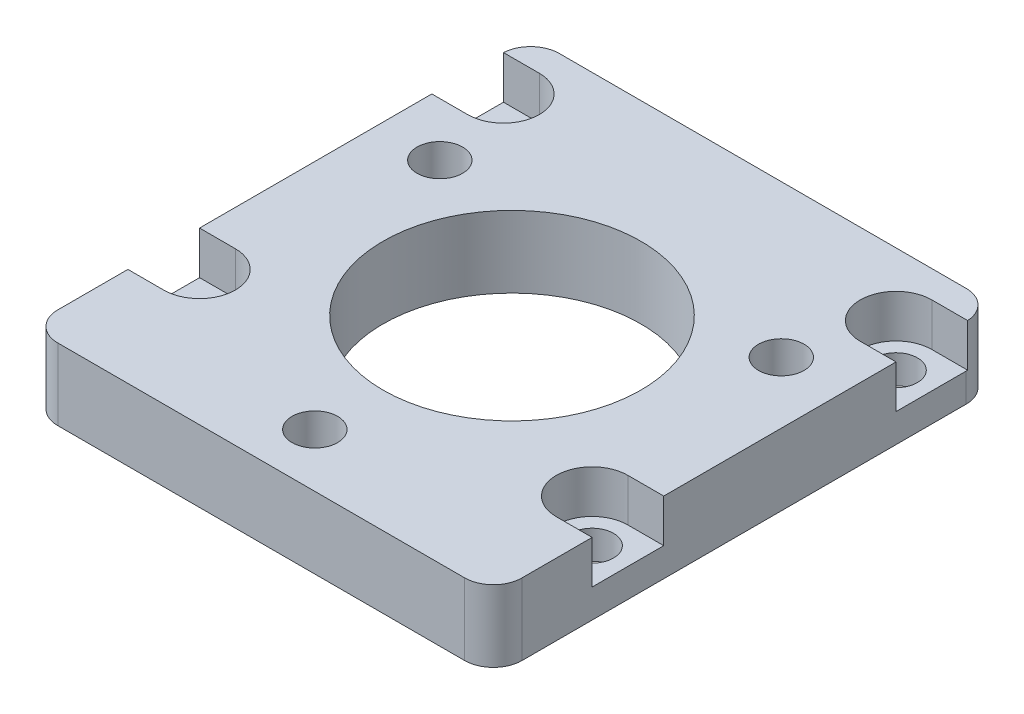
ISO-10303-21;
HEADER;
FILE_DESCRIPTION(('STEP AP214'),'2;1');
FILE_NAME('part.step','',(''),(''),'','','');
FILE_SCHEMA(('AUTOMOTIVE_DESIGN { 1 0 10303 214 1 1 1 1 }'));
ENDSEC;
DATA;
#1=APPLICATION_CONTEXT('core data for automotive mechanical design processes');
#2=APPLICATION_PROTOCOL_DEFINITION('international standard','automotive_design',2000,#1);
#3=PRODUCT_CONTEXT('',#1,'mechanical');
#4=PRODUCT('Part','Part','',(#3));
#5=PRODUCT_RELATED_PRODUCT_CATEGORY('part','',(#4));
#6=PRODUCT_DEFINITION_FORMATION('','',#4);
#7=PRODUCT_DEFINITION_CONTEXT('part definition',#1,'design');
#8=PRODUCT_DEFINITION('design','',#6,#7);
#9=PRODUCT_DEFINITION_SHAPE('','',#8);
#10=(LENGTH_UNIT() NAMED_UNIT(*) SI_UNIT(.MILLI.,.METRE.));
#11=(NAMED_UNIT(*) PLANE_ANGLE_UNIT() SI_UNIT($,.RADIAN.));
#12=(NAMED_UNIT(*) SI_UNIT($,.STERADIAN.) SOLID_ANGLE_UNIT());
#13=UNCERTAINTY_MEASURE_WITH_UNIT(LENGTH_MEASURE(1.E-05),#10,'distance_accuracy_value','');
#14=(GEOMETRIC_REPRESENTATION_CONTEXT(3) GLOBAL_UNCERTAINTY_ASSIGNED_CONTEXT((#13)) GLOBAL_UNIT_ASSIGNED_CONTEXT((#10,
#11,#12)) REPRESENTATION_CONTEXT('',''));
#15=CARTESIAN_POINT('',(0.,0.,0.));
#16=DIRECTION('',(0.,0.,1.));
#17=DIRECTION('',(1.,0.,0.));
#18=AXIS2_PLACEMENT_3D('',#15,#16,#17);
#19=CARTESIAN_POINT('',(-17.399,6.35,10.2953840772073));
#20=DIRECTION('',(0.,1.,0.));
#21=DIRECTION('',(0.,0.,1.));
#22=AXIS2_PLACEMENT_3D('',#19,#20,#21);
#23=CYLINDRICAL_SURFACE('',#22,1.89865);
#24=CARTESIAN_POINT('',(-17.399,0.,10.2953840772073));
#25=DIRECTION('',(0.,1.,0.));
#26=DIRECTION('',(0.,0.,1.));
#27=AXIS2_PLACEMENT_3D('',#24,#25,#26);
#28=CIRCLE('',#27,1.89865);
#29=CARTESIAN_POINT('',(-17.399,0.,12.1940340772073));
#30=VERTEX_POINT('',#29);
#31=EDGE_CURVE('E352',#30,#30,#28,.T.);
#32=ORIENTED_EDGE('',*,*,#31,.F.);
#33=EDGE_LOOP('',(#32));
#34=FACE_BOUND('',#33,.T.);
#35=CARTESIAN_POINT('',(-17.399,2.54,10.2953840772073));
#36=DIRECTION('',(0.,1.,0.));
#37=DIRECTION('',(0.,0.,1.));
#38=AXIS2_PLACEMENT_3D('',#35,#36,#37);
#39=CIRCLE('',#38,1.89865);
#40=CARTESIAN_POINT('',(-17.399,2.54,12.1940340772073));
#41=VERTEX_POINT('',#40);
#42=EDGE_CURVE('E328',#41,#41,#39,.F.);
#43=ORIENTED_EDGE('',*,*,#42,.F.);
#44=EDGE_LOOP('',(#43));
#45=FACE_BOUND('',#44,.T.);
#46=ADVANCED_FACE('F42',(#34,#45),#23,.F.);
#47=CARTESIAN_POINT('',(17.399,6.35,-16.645384286));
#48=DIRECTION('',(0.,1.,0.));
#49=DIRECTION('',(0.,0.,1.));
#50=AXIS2_PLACEMENT_3D('',#47,#48,#49);
#51=CYLINDRICAL_SURFACE('',#50,1.89865);
#52=CARTESIAN_POINT('',(17.399,0.,-16.645384286));
#53=DIRECTION('',(0.,1.,0.));
#54=DIRECTION('',(0.,0.,1.));
#55=AXIS2_PLACEMENT_3D('',#52,#53,#54);
#56=CIRCLE('',#55,1.89865);
#57=CARTESIAN_POINT('',(17.399,0.,-14.746734286));
#58=VERTEX_POINT('',#57);
#59=EDGE_CURVE('E346',#58,#58,#56,.T.);
#60=ORIENTED_EDGE('',*,*,#59,.F.);
#61=EDGE_LOOP('',(#60));
#62=FACE_BOUND('',#61,.T.);
#63=CARTESIAN_POINT('',(17.399,2.54,-16.645384286));
#64=DIRECTION('',(0.,1.,0.));
#65=DIRECTION('',(0.,0.,1.));
#66=AXIS2_PLACEMENT_3D('',#63,#64,#65);
#67=CIRCLE('',#66,1.89865);
#68=CARTESIAN_POINT('',(17.399,2.54,-14.746734286));
#69=VERTEX_POINT('',#68);
#70=EDGE_CURVE('E319',#69,#69,#67,.F.);
#71=ORIENTED_EDGE('',*,*,#70,.F.);
#72=EDGE_LOOP('',(#71));
#73=FACE_BOUND('',#72,.T.);
#74=ADVANCED_FACE('F505',(#62,#73),#51,.F.);
#75=CARTESIAN_POINT('',(-20.574,6.35,22.225));
#76=DIRECTION('',(1.,0.,0.));
#77=DIRECTION('',(0.,0.,-1.));
#78=AXIS2_PLACEMENT_3D('',#75,#76,#77);
#79=PLANE('',#78);
#80=DIRECTION('',(0.,0.,1.));
#81=VECTOR('',#80,1.);
#82=CARTESIAN_POINT('',(-20.574,6.35,22.225));
#83=LINE('',#82,#81);
#84=CARTESIAN_POINT('',(-20.574,6.35,13.470384286));
#85=VERTEX_POINT('',#84);
#86=CARTESIAN_POINT('',(-20.574,6.35,19.685));
#87=VERTEX_POINT('',#86);
#88=EDGE_CURVE('E362',#85,#87,#83,.T.);
#89=ORIENTED_EDGE('',*,*,#88,.F.);
#90=DIRECTION('',(0.,1.,0.));
#91=VECTOR('',#90,1.);
#92=CARTESIAN_POINT('',(-20.574,2.54,13.470384286));
#93=LINE('',#92,#91);
#94=CARTESIAN_POINT('',(-20.574,2.54,13.470384286));
#95=VERTEX_POINT('',#94);
#96=EDGE_CURVE('E287',#95,#85,#93,.T.);
#97=ORIENTED_EDGE('',*,*,#96,.F.);
#98=DIRECTION('',(0.,0.,1.));
#99=VECTOR('',#98,1.);
#100=CARTESIAN_POINT('',(-20.574,2.54,7.120384286));
#101=LINE('',#100,#99);
#102=CARTESIAN_POINT('',(-20.574,2.54,7.120384286));
#103=VERTEX_POINT('',#102);
#104=EDGE_CURVE('E275',#103,#95,#101,.T.);
#105=ORIENTED_EDGE('',*,*,#104,.F.);
#106=DIRECTION('',(0.,1.,0.));
#107=VECTOR('',#106,1.);
#108=CARTESIAN_POINT('',(-20.574,2.54,7.120384286));
#109=LINE('',#108,#107);
#110=CARTESIAN_POINT('',(-20.574,6.35,7.120384286));
#111=VERTEX_POINT('',#110);
#112=EDGE_CURVE('E289',#103,#111,#109,.T.);
#113=ORIENTED_EDGE('',*,*,#112,.T.);
#114=CARTESIAN_POINT('',(-20.574,6.35,-13.470384286));
#115=VERTEX_POINT('',#114);
#116=EDGE_CURVE('E364',#115,#111,#83,.T.);
#117=ORIENTED_EDGE('',*,*,#116,.F.);
#118=DIRECTION('',(0.,1.,0.));
#119=VECTOR('',#118,1.);
#120=CARTESIAN_POINT('',(-20.574,2.54,-13.470384286));
#121=LINE('',#120,#119);
#122=CARTESIAN_POINT('',(-20.574,2.54,-13.470384286));
#123=VERTEX_POINT('',#122);
#124=EDGE_CURVE('E314',#123,#115,#121,.T.);
#125=ORIENTED_EDGE('',*,*,#124,.F.);
#126=DIRECTION('',(0.,0.,1.));
#127=VECTOR('',#126,1.);
#128=CARTESIAN_POINT('',(-20.574,2.54,-13.470384286));
#129=LINE('',#128,#127);
#130=CARTESIAN_POINT('',(-20.574,2.54,-19.685));
#131=VERTEX_POINT('',#130);
#132=EDGE_CURVE('E299',#131,#123,#129,.T.);
#133=ORIENTED_EDGE('',*,*,#132,.F.);
#134=DIRECTION('',(0.,-1.,0.));
#135=VECTOR('',#134,1.);
#136=CARTESIAN_POINT('',(-20.574,6.35,-19.685));
#137=LINE('',#136,#135);
#138=CARTESIAN_POINT('',(-20.574,0.,-19.685));
#139=VERTEX_POINT('',#138);
#140=EDGE_CURVE('E389',#131,#139,#137,.T.);
#141=ORIENTED_EDGE('',*,*,#140,.T.);
#142=DIRECTION('',(0.,0.,1.));
#143=VECTOR('',#142,1.);
#144=CARTESIAN_POINT('',(-20.574,0.,22.225));
#145=LINE('',#144,#143);
#146=CARTESIAN_POINT('',(-20.574,0.,19.685));
#147=VERTEX_POINT('',#146);
#148=EDGE_CURVE('E359',#139,#147,#145,.T.);
#149=ORIENTED_EDGE('',*,*,#148,.T.);
#150=DIRECTION('',(0.,-1.,0.));
#151=VECTOR('',#150,1.);
#152=CARTESIAN_POINT('',(-20.574,6.35,19.685));
#153=LINE('',#152,#151);
#154=EDGE_CURVE('E376',#147,#87,#153,.F.);
#155=ORIENTED_EDGE('',*,*,#154,.T.);
#156=EDGE_LOOP('',(#89,#97,#105,#113,#117,#125,#133,#141,#149,#155));
#157=FACE_BOUND('',#156,.T.);
#158=ADVANCED_FACE('F474',(#157),#79,.F.);
#159=CARTESIAN_POINT('',(20.574,6.35,22.225));
#160=DIRECTION('',(0.,0.,-1.));
#161=DIRECTION('',(-1.,0.,0.));
#162=AXIS2_PLACEMENT_3D('',#159,#160,#161);
#163=PLANE('',#162);
#164=DIRECTION('',(1.,0.,0.));
#165=VECTOR('',#164,1.);
#166=CARTESIAN_POINT('',(20.574,0.,22.225));
#167=LINE('',#166,#165);
#168=CARTESIAN_POINT('',(-18.034,0.,22.225));
#169=VERTEX_POINT('',#168);
#170=CARTESIAN_POINT('',(18.034,0.,22.225));
#171=VERTEX_POINT('',#170);
#172=EDGE_CURVE('E379',#169,#171,#167,.T.);
#173=ORIENTED_EDGE('',*,*,#172,.T.);
#174=DIRECTION('',(0.,-1.,0.));
#175=VECTOR('',#174,1.);
#176=CARTESIAN_POINT('',(18.034,6.35,22.225));
#177=LINE('',#176,#175);
#178=CARTESIAN_POINT('',(18.034,6.35,22.225));
#179=VERTEX_POINT('',#178);
#180=EDGE_CURVE('E422',#171,#179,#177,.F.);
#181=ORIENTED_EDGE('',*,*,#180,.T.);
#182=DIRECTION('',(1.,0.,0.));
#183=VECTOR('',#182,1.);
#184=CARTESIAN_POINT('',(20.574,6.35,22.225));
#185=LINE('',#184,#183);
#186=CARTESIAN_POINT('',(-18.034,6.35,22.225));
#187=VERTEX_POINT('',#186);
#188=EDGE_CURVE('E366',#187,#179,#185,.T.);
#189=ORIENTED_EDGE('',*,*,#188,.F.);
#190=DIRECTION('',(0.,-1.,0.));
#191=VECTOR('',#190,1.);
#192=CARTESIAN_POINT('',(-18.034,6.35,22.225));
#193=LINE('',#192,#191);
#194=EDGE_CURVE('E419',#187,#169,#193,.T.);
#195=ORIENTED_EDGE('',*,*,#194,.T.);
#196=EDGE_LOOP('',(#173,#181,#189,#195));
#197=FACE_BOUND('',#196,.T.);
#198=ADVANCED_FACE('F532',(#197),#163,.F.);
#199=CARTESIAN_POINT('',(20.574,6.35,22.225));
#200=DIRECTION('',(-1.,0.,0.));
#201=DIRECTION('',(0.,0.,1.));
#202=AXIS2_PLACEMENT_3D('',#199,#200,#201);
#203=PLANE('',#202);
#204=DIRECTION('',(0.,0.,-1.));
#205=VECTOR('',#204,1.);
#206=CARTESIAN_POINT('',(20.574,6.35,22.225));
#207=LINE('',#206,#205);
#208=CARTESIAN_POINT('',(20.574,6.35,7.120384286));
#209=VERTEX_POINT('',#208);
#210=CARTESIAN_POINT('',(20.574,6.35,-13.470384286));
#211=VERTEX_POINT('',#210);
#212=EDGE_CURVE('E369',#209,#211,#207,.T.);
#213=ORIENTED_EDGE('',*,*,#212,.F.);
#214=DIRECTION('',(0.,1.,0.));
#215=VECTOR('',#214,1.);
#216=CARTESIAN_POINT('',(20.574,2.54,7.120384286));
#217=LINE('',#216,#215);
#218=CARTESIAN_POINT('',(20.574,2.54,7.120384286));
#219=VERTEX_POINT('',#218);
#220=EDGE_CURVE('E262',#219,#209,#217,.T.);
#221=ORIENTED_EDGE('',*,*,#220,.F.);
#222=DIRECTION('',(0.,0.,-1.));
#223=VECTOR('',#222,1.);
#224=CARTESIAN_POINT('',(20.574,2.54,7.120384286));
#225=LINE('',#224,#223);
#226=CARTESIAN_POINT('',(20.574,2.54,13.470384286));
#227=VERTEX_POINT('',#226);
#228=EDGE_CURVE('E249',#227,#219,#225,.T.);
#229=ORIENTED_EDGE('',*,*,#228,.F.);
#230=DIRECTION('',(0.,1.,0.));
#231=VECTOR('',#230,1.);
#232=CARTESIAN_POINT('',(20.574,2.54,13.470384286));
#233=LINE('',#232,#231);
#234=CARTESIAN_POINT('',(20.574,6.35,13.470384286));
#235=VERTEX_POINT('',#234);
#236=EDGE_CURVE('E264',#227,#235,#233,.T.);
#237=ORIENTED_EDGE('',*,*,#236,.T.);
#238=CARTESIAN_POINT('',(20.574,6.35,19.685));
#239=VERTEX_POINT('',#238);
#240=EDGE_CURVE('E370',#239,#235,#207,.T.);
#241=ORIENTED_EDGE('',*,*,#240,.F.);
#242=DIRECTION('',(0.,-1.,0.));
#243=VECTOR('',#242,1.);
#244=CARTESIAN_POINT('',(20.574,6.35,19.685));
#245=LINE('',#244,#243);
#246=CARTESIAN_POINT('',(20.574,0.,19.685));
#247=VERTEX_POINT('',#246);
#248=EDGE_CURVE('E413',#239,#247,#245,.T.);
#249=ORIENTED_EDGE('',*,*,#248,.T.);
#250=DIRECTION('',(0.,0.,-1.));
#251=VECTOR('',#250,1.);
#252=CARTESIAN_POINT('',(20.574,0.,22.225));
#253=LINE('',#252,#251);
#254=CARTESIAN_POINT('',(20.574,0.,-19.685));
#255=VERTEX_POINT('',#254);
#256=EDGE_CURVE('E382',#247,#255,#253,.T.);
#257=ORIENTED_EDGE('',*,*,#256,.T.);
#258=DIRECTION('',(0.,-1.,0.));
#259=VECTOR('',#258,1.);
#260=CARTESIAN_POINT('',(20.574,6.35,-19.685));
#261=LINE('',#260,#259);
#262=CARTESIAN_POINT('',(20.574,2.54,-19.685));
#263=VERTEX_POINT('',#262);
#264=EDGE_CURVE('E416',#255,#263,#261,.F.);
#265=ORIENTED_EDGE('',*,*,#264,.T.);
#266=DIRECTION('',(0.,0.,-1.));
#267=VECTOR('',#266,1.);
#268=CARTESIAN_POINT('',(20.574,2.54,-13.470384286));
#269=LINE('',#268,#267);
#270=CARTESIAN_POINT('',(20.574,2.54,-13.470384286));
#271=VERTEX_POINT('',#270);
#272=EDGE_CURVE('E222',#271,#263,#269,.T.);
#273=ORIENTED_EDGE('',*,*,#272,.F.);
#274=DIRECTION('',(0.,1.,0.));
#275=VECTOR('',#274,1.);
#276=CARTESIAN_POINT('',(20.574,2.54,-13.470384286));
#277=LINE('',#276,#275);
#278=EDGE_CURVE('E213',#271,#211,#277,.T.);
#279=ORIENTED_EDGE('',*,*,#278,.T.);
#280=EDGE_LOOP('',(#213,#221,#229,#237,#241,#249,#257,#265,#273,#279));
#281=FACE_BOUND('',#280,.T.);
#282=ADVANCED_FACE('F529',(#281),#203,.F.);
#283=CARTESIAN_POINT('',(20.574,6.35,-22.225));
#284=DIRECTION('',(0.,0.,1.));
#285=DIRECTION('',(1.,0.,0.));
#286=AXIS2_PLACEMENT_3D('',#283,#284,#285);
#287=PLANE('',#286);
#288=DIRECTION('',(-1.,0.,0.));
#289=VECTOR('',#288,1.);
#290=CARTESIAN_POINT('',(20.574,0.,-22.225));
#291=LINE('',#290,#289);
#292=CARTESIAN_POINT('',(18.034,0.,-22.225));
#293=VERTEX_POINT('',#292);
#294=CARTESIAN_POINT('',(-18.034,0.,-22.225));
#295=VERTEX_POINT('',#294);
#296=EDGE_CURVE('E365',#293,#295,#291,.T.);
#297=ORIENTED_EDGE('',*,*,#296,.T.);
#298=DIRECTION('',(0.,-1.,0.));
#299=VECTOR('',#298,1.);
#300=CARTESIAN_POINT('',(-18.034,6.35,-22.225));
#301=LINE('',#300,#299);
#302=CARTESIAN_POINT('',(-18.034,6.35,-22.225));
#303=VERTEX_POINT('',#302);
#304=EDGE_CURVE('E402',#295,#303,#301,.F.);
#305=ORIENTED_EDGE('',*,*,#304,.T.);
#306=DIRECTION('',(-1.,0.,0.));
#307=VECTOR('',#306,1.);
#308=CARTESIAN_POINT('',(20.574,6.35,-22.225));
#309=LINE('',#308,#307);
#310=CARTESIAN_POINT('',(18.034,6.35,-22.225));
#311=VERTEX_POINT('',#310);
#312=EDGE_CURVE('E373',#311,#303,#309,.T.);
#313=ORIENTED_EDGE('',*,*,#312,.F.);
#314=DIRECTION('',(0.,-1.,0.));
#315=VECTOR('',#314,1.);
#316=CARTESIAN_POINT('',(18.034,6.35,-22.225));
#317=LINE('',#316,#315);
#318=EDGE_CURVE('E399',#311,#293,#317,.T.);
#319=ORIENTED_EDGE('',*,*,#318,.T.);
#320=EDGE_LOOP('',(#297,#305,#313,#319));
#321=FACE_BOUND('',#320,.T.);
#322=ADVANCED_FACE('F447',(#321),#287,.F.);
#323=CARTESIAN_POINT('',(0.,6.35,0.));
#324=DIRECTION('',(0.,1.,0.));
#325=DIRECTION('',(0.,0.,1.));
#326=AXIS2_PLACEMENT_3D('',#323,#324,#325);
#327=PLANE('',#326);
#328=DIRECTION('',(1.,0.,0.));
#329=VECTOR('',#328,1.);
#330=CARTESIAN_POINT('',(-20.574,6.35,13.470384286));
#331=LINE('',#330,#329);
#332=CARTESIAN_POINT('',(-17.399,6.35,13.470384286));
#333=VERTEX_POINT('',#332);
#334=EDGE_CURVE('E272',#85,#333,#331,.T.);
#335=ORIENTED_EDGE('',*,*,#334,.F.);
#336=ORIENTED_EDGE('',*,*,#88,.T.);
#337=CARTESIAN_POINT('',(-18.034,6.35,19.685));
#338=DIRECTION('',(0.,1.,0.));
#339=DIRECTION('',(0.,0.,1.));
#340=AXIS2_PLACEMENT_3D('',#337,#338,#339);
#341=CIRCLE('',#340,2.54);
#342=EDGE_CURVE('E404',#87,#187,#341,.T.);
#343=ORIENTED_EDGE('',*,*,#342,.T.);
#344=ORIENTED_EDGE('',*,*,#188,.T.);
#345=CARTESIAN_POINT('',(18.034,6.35,19.685));
#346=DIRECTION('',(0.,1.,0.));
#347=DIRECTION('',(0.,0.,1.));
#348=AXIS2_PLACEMENT_3D('',#345,#346,#347);
#349=CIRCLE('',#348,2.54);
#350=EDGE_CURVE('E406',#179,#239,#349,.T.);
#351=ORIENTED_EDGE('',*,*,#350,.T.);
#352=ORIENTED_EDGE('',*,*,#240,.T.);
#353=DIRECTION('',(1.,0.,0.));
#354=VECTOR('',#353,1.);
#355=CARTESIAN_POINT('',(20.574,6.35,13.470384286));
#356=LINE('',#355,#354);
#357=CARTESIAN_POINT('',(17.399,6.35,13.470384286));
#358=VERTEX_POINT('',#357);
#359=EDGE_CURVE('E256',#358,#235,#356,.T.);
#360=ORIENTED_EDGE('',*,*,#359,.F.);
#361=CARTESIAN_POINT('',(17.399,6.35,10.295384286));
#362=DIRECTION('',(0.,1.,0.));
#363=DIRECTION('',(0.,0.,-1.));
#364=AXIS2_PLACEMENT_3D('',#361,#362,#363);
#365=CIRCLE('',#364,3.175);
#366=CARTESIAN_POINT('',(17.399,6.35,7.120384286));
#367=VERTEX_POINT('',#366);
#368=EDGE_CURVE('E65',#367,#358,#365,.T.);
#369=ORIENTED_EDGE('',*,*,#368,.F.);
#370=DIRECTION('',(-1.,0.,0.));
#371=VECTOR('',#370,1.);
#372=CARTESIAN_POINT('',(17.399,6.35,7.120384286));
#373=LINE('',#372,#371);
#374=EDGE_CURVE('E246',#209,#367,#373,.T.);
#375=ORIENTED_EDGE('',*,*,#374,.F.);
#376=ORIENTED_EDGE('',*,*,#212,.T.);
#377=DIRECTION('',(1.,0.,0.));
#378=VECTOR('',#377,1.);
#379=CARTESIAN_POINT('',(17.399,6.35,-13.470384286));
#380=LINE('',#379,#378);
#381=CARTESIAN_POINT('',(17.399,6.35,-13.470384286));
#382=VERTEX_POINT('',#381);
#383=EDGE_CURVE('E230',#382,#211,#380,.T.);
#384=ORIENTED_EDGE('',*,*,#383,.F.);
#385=CARTESIAN_POINT('',(17.399,6.35,-16.645384286));
#386=DIRECTION('',(0.,1.,0.));
#387=DIRECTION('',(0.,0.,1.));
#388=AXIS2_PLACEMENT_3D('',#385,#386,#387);
#389=CIRCLE('',#388,3.175);
#390=CARTESIAN_POINT('',(17.399,6.35,-19.820384286));
#391=VERTEX_POINT('',#390);
#392=EDGE_CURVE('E210',#391,#382,#389,.T.);
#393=ORIENTED_EDGE('',*,*,#392,.F.);
#394=DIRECTION('',(-1.,0.,0.));
#395=VECTOR('',#394,1.);
#396=CARTESIAN_POINT('',(20.574,6.35,-19.820384286));
#397=LINE('',#396,#395);
#398=CARTESIAN_POINT('',(20.5703893816022,6.35,-19.820384286));
#399=VERTEX_POINT('',#398);
#400=EDGE_CURVE('E228',#399,#391,#397,.T.);
#401=ORIENTED_EDGE('',*,*,#400,.F.);
#402=CARTESIAN_POINT('',(18.034,6.35,-19.685));
#403=DIRECTION('',(0.,1.,0.));
#404=DIRECTION('',(0.,0.,1.));
#405=AXIS2_PLACEMENT_3D('',#402,#403,#404);
#406=CIRCLE('',#405,2.54);
#407=EDGE_CURVE('E408',#399,#311,#406,.T.);
#408=ORIENTED_EDGE('',*,*,#407,.T.);
#409=ORIENTED_EDGE('',*,*,#312,.T.);
#410=CARTESIAN_POINT('',(-18.034,6.35,-19.685));
#411=DIRECTION('',(0.,1.,0.));
#412=DIRECTION('',(0.,0.,1.));
#413=AXIS2_PLACEMENT_3D('',#410,#411,#412);
#414=CIRCLE('',#413,2.54);
#415=CARTESIAN_POINT('',(-20.5703893816022,6.35,-19.820384286));
#416=VERTEX_POINT('',#415);
#417=EDGE_CURVE('E410',#303,#416,#414,.T.);
#418=ORIENTED_EDGE('',*,*,#417,.T.);
#419=DIRECTION('',(-1.,0.,0.));
#420=VECTOR('',#419,1.);
#421=CARTESIAN_POINT('',(-20.574,6.35,-19.820384286));
#422=LINE('',#421,#420);
#423=CARTESIAN_POINT('',(-17.399,6.35,-19.820384286));
#424=VERTEX_POINT('',#423);
#425=EDGE_CURVE('E307',#424,#416,#422,.T.);
#426=ORIENTED_EDGE('',*,*,#425,.F.);
#427=CARTESIAN_POINT('',(-17.399,6.35,-16.645384286));
#428=DIRECTION('',(0.,1.,0.));
#429=DIRECTION('',(0.,0.,-1.));
#430=AXIS2_PLACEMENT_3D('',#427,#428,#429);
#431=CIRCLE('',#430,3.175);
#432=CARTESIAN_POINT('',(-17.399,6.35,-13.470384286));
#433=VERTEX_POINT('',#432);
#434=EDGE_CURVE('E240',#433,#424,#431,.T.);
#435=ORIENTED_EDGE('',*,*,#434,.F.);
#436=DIRECTION('',(1.,0.,0.));
#437=VECTOR('',#436,1.);
#438=CARTESIAN_POINT('',(-17.399,6.35,-13.470384286));
#439=LINE('',#438,#437);
#440=EDGE_CURVE('E297',#115,#433,#439,.T.);
#441=ORIENTED_EDGE('',*,*,#440,.F.);
#442=ORIENTED_EDGE('',*,*,#116,.T.);
#443=DIRECTION('',(-1.,0.,0.));
#444=VECTOR('',#443,1.);
#445=CARTESIAN_POINT('',(-17.399,6.35,7.120384286));
#446=LINE('',#445,#444);
#447=CARTESIAN_POINT('',(-17.399,6.35,7.120384286));
#448=VERTEX_POINT('',#447);
#449=EDGE_CURVE('E282',#448,#111,#446,.T.);
#450=ORIENTED_EDGE('',*,*,#449,.F.);
#451=CARTESIAN_POINT('',(-17.399,6.35,10.295384286));
#452=DIRECTION('',(0.,1.,0.));
#453=DIRECTION('',(0.,0.,1.));
#454=AXIS2_PLACEMENT_3D('',#451,#452,#453);
#455=CIRCLE('',#454,3.175);
#456=EDGE_CURVE('E57',#333,#448,#455,.T.);
#457=ORIENTED_EDGE('',*,*,#456,.F.);
#458=EDGE_LOOP('',(#335,#336,#343,#344,#351,#352,#360,#369,#375,#376,#384,#393,#401,#408,#409,
#418,#426,#435,#441,#442,#450,#457));
#459=FACE_BOUND('',#458,.T.);
#460=CARTESIAN_POINT('',(-15.1339671362138,6.35,-8.73760000000007));
#461=DIRECTION('',(0.,1.,0.));
#462=DIRECTION('',(0.,0.,1.));
#463=AXIS2_PLACEMENT_3D('',#460,#461,#462);
#464=CIRCLE('',#463,2.0193);
#465=CARTESIAN_POINT('',(-15.1339671362138,6.35,-6.71830000000007));
#466=VERTEX_POINT('',#465);
#467=EDGE_CURVE('E324',#466,#466,#464,.T.);
#468=ORIENTED_EDGE('',*,*,#467,.F.);
#469=EDGE_LOOP('',(#468));
#470=FACE_BOUND('',#469,.T.);
#471=CARTESIAN_POINT('',(15.1339671362139,6.35,-8.73759999999986));
#472=DIRECTION('',(0.,1.,0.));
#473=DIRECTION('',(0.,0.,1.));
#474=AXIS2_PLACEMENT_3D('',#471,#472,#473);
#475=CIRCLE('',#474,2.0193);
#476=CARTESIAN_POINT('',(15.1339671362139,6.35,-6.71829999999986));
#477=VERTEX_POINT('',#476);
#478=EDGE_CURVE('E331',#477,#477,#475,.T.);
#479=ORIENTED_EDGE('',*,*,#478,.F.);
#480=EDGE_LOOP('',(#479));
#481=FACE_BOUND('',#480,.T.);
#482=CARTESIAN_POINT('',(0.,6.35,17.4752));
#483=DIRECTION('',(0.,1.,0.));
#484=DIRECTION('',(0.,0.,1.));
#485=AXIS2_PLACEMENT_3D('',#482,#483,#484);
#486=CIRCLE('',#485,2.0193);
#487=CARTESIAN_POINT('',(0.,6.35,19.4945));
#488=VERTEX_POINT('',#487);
#489=EDGE_CURVE('E337',#488,#488,#486,.T.);
#490=ORIENTED_EDGE('',*,*,#489,.F.);
#491=EDGE_LOOP('',(#490));
#492=FACE_BOUND('',#491,.T.);
#493=CARTESIAN_POINT('',(0.,6.35,0.));
#494=DIRECTION('',(0.,1.,0.));
#495=DIRECTION('',(0.,0.,1.));
#496=AXIS2_PLACEMENT_3D('',#493,#494,#495);
#497=CIRCLE('',#496,11.43);
#498=CARTESIAN_POINT('',(0.,6.35,11.43));
#499=VERTEX_POINT('',#498);
#500=EDGE_CURVE('E355',#499,#499,#497,.T.);
#501=ORIENTED_EDGE('',*,*,#500,.F.);
#502=EDGE_LOOP('',(#501));
#503=FACE_BOUND('',#502,.T.);
#504=ADVANCED_FACE('F439',(#459,#470,#481,#492,#503),#327,.T.);
#505=CARTESIAN_POINT('',(0.,0.,0.));
#506=DIRECTION('',(0.,1.,0.));
#507=DIRECTION('',(0.,0.,1.));
#508=AXIS2_PLACEMENT_3D('',#505,#506,#507);
#509=PLANE('',#508);
#510=CARTESIAN_POINT('',(-15.1339671362138,0.,-8.73760000000007));
#511=DIRECTION('',(0.,1.,0.));
#512=DIRECTION('',(0.,0.,1.));
#513=AXIS2_PLACEMENT_3D('',#510,#511,#512);
#514=CIRCLE('',#513,2.0193);
#515=CARTESIAN_POINT('',(-15.1339671362138,0.,-6.71830000000007));
#516=VERTEX_POINT('',#515);
#517=EDGE_CURVE('E327',#516,#516,#514,.T.);
#518=ORIENTED_EDGE('',*,*,#517,.T.);
#519=EDGE_LOOP('',(#518));
#520=FACE_BOUND('',#519,.T.);
#521=CARTESIAN_POINT('',(15.1339671362139,0.,-8.73759999999986));
#522=DIRECTION('',(0.,1.,0.));
#523=DIRECTION('',(0.,0.,1.));
#524=AXIS2_PLACEMENT_3D('',#521,#522,#523);
#525=CIRCLE('',#524,2.0193);
#526=CARTESIAN_POINT('',(15.1339671362139,0.,-6.71829999999986));
#527=VERTEX_POINT('',#526);
#528=EDGE_CURVE('E334',#527,#527,#525,.T.);
#529=ORIENTED_EDGE('',*,*,#528,.T.);
#530=EDGE_LOOP('',(#529));
#531=FACE_BOUND('',#530,.T.);
#532=CARTESIAN_POINT('',(0.,0.,17.4752));
#533=DIRECTION('',(0.,1.,0.));
#534=DIRECTION('',(0.,0.,1.));
#535=AXIS2_PLACEMENT_3D('',#532,#533,#534);
#536=CIRCLE('',#535,2.0193);
#537=CARTESIAN_POINT('',(0.,0.,19.4945));
#538=VERTEX_POINT('',#537);
#539=EDGE_CURVE('E340',#538,#538,#536,.T.);
#540=ORIENTED_EDGE('',*,*,#539,.T.);
#541=EDGE_LOOP('',(#540));
#542=FACE_BOUND('',#541,.T.);
#543=CARTESIAN_POINT('',(-17.399,0.,-16.645384286));
#544=DIRECTION('',(0.,1.,0.));
#545=DIRECTION('',(0.,0.,1.));
#546=AXIS2_PLACEMENT_3D('',#543,#544,#545);
#547=CIRCLE('',#546,1.89865);
#548=CARTESIAN_POINT('',(-17.399,0.,-14.746734286));
#549=VERTEX_POINT('',#548);
#550=EDGE_CURVE('E343',#549,#549,#547,.T.);
#551=ORIENTED_EDGE('',*,*,#550,.T.);
#552=EDGE_LOOP('',(#551));
#553=FACE_BOUND('',#552,.T.);
#554=ORIENTED_EDGE('',*,*,#59,.T.);
#555=EDGE_LOOP('',(#554));
#556=FACE_BOUND('',#555,.T.);
#557=CARTESIAN_POINT('',(17.399,0.,10.2953840772073));
#558=DIRECTION('',(0.,1.,0.));
#559=DIRECTION('',(0.,0.,1.));
#560=AXIS2_PLACEMENT_3D('',#557,#558,#559);
#561=CIRCLE('',#560,1.89865);
#562=CARTESIAN_POINT('',(17.399,0.,12.1940340772073));
#563=VERTEX_POINT('',#562);
#564=EDGE_CURVE('E349',#563,#563,#561,.T.);
#565=ORIENTED_EDGE('',*,*,#564,.T.);
#566=EDGE_LOOP('',(#565));
#567=FACE_BOUND('',#566,.T.);
#568=ORIENTED_EDGE('',*,*,#31,.T.);
#569=EDGE_LOOP('',(#568));
#570=FACE_BOUND('',#569,.T.);
#571=CARTESIAN_POINT('',(0.,0.,0.));
#572=DIRECTION('',(0.,1.,0.));
#573=DIRECTION('',(0.,0.,1.));
#574=AXIS2_PLACEMENT_3D('',#571,#572,#573);
#575=CIRCLE('',#574,11.43);
#576=CARTESIAN_POINT('',(0.,0.,11.43));
#577=VERTEX_POINT('',#576);
#578=EDGE_CURVE('E356',#577,#577,#575,.T.);
#579=ORIENTED_EDGE('',*,*,#578,.T.);
#580=EDGE_LOOP('',(#579));
#581=FACE_BOUND('',#580,.T.);
#582=ORIENTED_EDGE('',*,*,#148,.F.);
#583=CARTESIAN_POINT('',(-18.034,0.,-19.685));
#584=DIRECTION('',(0.,1.,0.));
#585=DIRECTION('',(0.,0.,1.));
#586=AXIS2_PLACEMENT_3D('',#583,#584,#585);
#587=CIRCLE('',#586,2.54);
#588=EDGE_CURVE('E397',#139,#295,#587,.F.);
#589=ORIENTED_EDGE('',*,*,#588,.T.);
#590=ORIENTED_EDGE('',*,*,#296,.F.);
#591=CARTESIAN_POINT('',(18.034,0.,-19.685));
#592=DIRECTION('',(0.,1.,0.));
#593=DIRECTION('',(0.,0.,1.));
#594=AXIS2_PLACEMENT_3D('',#591,#592,#593);
#595=CIRCLE('',#594,2.54);
#596=EDGE_CURVE('E395',#293,#255,#595,.F.);
#597=ORIENTED_EDGE('',*,*,#596,.T.);
#598=ORIENTED_EDGE('',*,*,#256,.F.);
#599=CARTESIAN_POINT('',(18.034,0.,19.685));
#600=DIRECTION('',(0.,1.,0.));
#601=DIRECTION('',(0.,0.,1.));
#602=AXIS2_PLACEMENT_3D('',#599,#600,#601);
#603=CIRCLE('',#602,2.54);
#604=EDGE_CURVE('E393',#247,#171,#603,.F.);
#605=ORIENTED_EDGE('',*,*,#604,.T.);
#606=ORIENTED_EDGE('',*,*,#172,.F.);
#607=CARTESIAN_POINT('',(-18.034,0.,19.685));
#608=DIRECTION('',(0.,1.,0.));
#609=DIRECTION('',(0.,0.,1.));
#610=AXIS2_PLACEMENT_3D('',#607,#608,#609);
#611=CIRCLE('',#610,2.54);
#612=EDGE_CURVE('E391',#169,#147,#611,.F.);
#613=ORIENTED_EDGE('',*,*,#612,.T.);
#614=EDGE_LOOP('',(#582,#589,#590,#597,#598,#605,#606,#613));
#615=FACE_BOUND('',#614,.T.);
#616=ADVANCED_FACE('F451',(#520,#531,#542,#553,#556,#567,#570,#581,#615),#509,.F.);
#617=CARTESIAN_POINT('',(-18.034,6.35,-19.685));
#618=DIRECTION('',(0.,-1.,0.));
#619=DIRECTION('',(0.,0.,-1.));
#620=AXIS2_PLACEMENT_3D('',#617,#618,#619);
#621=CYLINDRICAL_SURFACE('',#620,2.54);
#622=DIRECTION('',(0.,-1.,0.));
#623=VECTOR('',#622,1.);
#624=CARTESIAN_POINT('',(-20.5703893816022,6.35,-19.820384286));
#625=LINE('',#624,#623);
#626=CARTESIAN_POINT('',(-20.5703893816022,2.54,-19.820384286));
#627=VERTEX_POINT('',#626);
#628=EDGE_CURVE('E11',#416,#627,#625,.T.);
#629=ORIENTED_EDGE('',*,*,#628,.F.);
#630=ORIENTED_EDGE('',*,*,#417,.F.);
#631=ORIENTED_EDGE('',*,*,#304,.F.);
#632=ORIENTED_EDGE('',*,*,#588,.F.);
#633=ORIENTED_EDGE('',*,*,#140,.F.);
#634=CARTESIAN_POINT('',(-18.034,2.54,-19.685));
#635=DIRECTION('',(0.,-1.,0.));
#636=DIRECTION('',(0.,0.,-1.));
#637=AXIS2_PLACEMENT_3D('',#634,#635,#636);
#638=CIRCLE('',#637,2.54);
#639=EDGE_CURVE('E317',#627,#131,#638,.F.);
#640=ORIENTED_EDGE('',*,*,#639,.F.);
#641=EDGE_LOOP('',(#629,#630,#631,#632,#633,#640));
#642=FACE_BOUND('',#641,.T.);
#643=ADVANCED_FACE('F457',(#642),#621,.T.);
#644=CARTESIAN_POINT('',(18.034,6.35,-19.685));
#645=DIRECTION('',(0.,-1.,0.));
#646=DIRECTION('',(0.,0.,-1.));
#647=AXIS2_PLACEMENT_3D('',#644,#645,#646);
#648=CYLINDRICAL_SURFACE('',#647,2.54);
#649=DIRECTION('',(0.,-1.,0.));
#650=VECTOR('',#649,1.);
#651=CARTESIAN_POINT('',(20.5703893816022,6.35,-19.820384286));
#652=LINE('',#651,#650);
#653=CARTESIAN_POINT('',(20.5703893816022,2.54,-19.820384286));
#654=VERTEX_POINT('',#653);
#655=EDGE_CURVE('E50',#654,#399,#652,.F.);
#656=ORIENTED_EDGE('',*,*,#655,.F.);
#657=CARTESIAN_POINT('',(18.034,2.54,-19.685));
#658=DIRECTION('',(0.,1.,0.));
#659=DIRECTION('',(0.,0.,1.));
#660=AXIS2_PLACEMENT_3D('',#657,#658,#659);
#661=CIRCLE('',#660,2.54);
#662=EDGE_CURVE('E320',#654,#263,#661,.F.);
#663=ORIENTED_EDGE('',*,*,#662,.T.);
#664=ORIENTED_EDGE('',*,*,#264,.F.);
#665=ORIENTED_EDGE('',*,*,#596,.F.);
#666=ORIENTED_EDGE('',*,*,#318,.F.);
#667=ORIENTED_EDGE('',*,*,#407,.F.);
#668=EDGE_LOOP('',(#656,#663,#664,#665,#666,#667));
#669=FACE_BOUND('',#668,.T.);
#670=ADVANCED_FACE('F443',(#669),#648,.T.);
#671=CARTESIAN_POINT('',(18.034,6.35,19.685));
#672=DIRECTION('',(0.,-1.,0.));
#673=DIRECTION('',(0.,0.,-1.));
#674=AXIS2_PLACEMENT_3D('',#671,#672,#673);
#675=CYLINDRICAL_SURFACE('',#674,2.54);
#676=ORIENTED_EDGE('',*,*,#350,.F.);
#677=ORIENTED_EDGE('',*,*,#180,.F.);
#678=ORIENTED_EDGE('',*,*,#604,.F.);
#679=ORIENTED_EDGE('',*,*,#248,.F.);
#680=EDGE_LOOP('',(#676,#677,#678,#679));
#681=FACE_BOUND('',#680,.T.);
#682=ADVANCED_FACE('F542',(#681),#675,.T.);
#683=CARTESIAN_POINT('',(-18.034,6.35,19.685));
#684=DIRECTION('',(0.,-1.,0.));
#685=DIRECTION('',(0.,0.,-1.));
#686=AXIS2_PLACEMENT_3D('',#683,#684,#685);
#687=CYLINDRICAL_SURFACE('',#686,2.54);
#688=ORIENTED_EDGE('',*,*,#342,.F.);
#689=ORIENTED_EDGE('',*,*,#154,.F.);
#690=ORIENTED_EDGE('',*,*,#612,.F.);
#691=ORIENTED_EDGE('',*,*,#194,.F.);
#692=EDGE_LOOP('',(#688,#689,#690,#691));
#693=FACE_BOUND('',#692,.T.);
#694=ADVANCED_FACE('F44',(#693),#687,.T.);
#695=CARTESIAN_POINT('',(0.,0.,0.));
#696=DIRECTION('',(0.,1.,0.));
#697=DIRECTION('',(0.,0.,1.));
#698=AXIS2_PLACEMENT_3D('',#695,#696,#697);
#699=CYLINDRICAL_SURFACE('',#698,11.43);
#700=ORIENTED_EDGE('',*,*,#578,.F.);
#701=EDGE_LOOP('',(#700));
#702=FACE_BOUND('',#701,.T.);
#703=ORIENTED_EDGE('',*,*,#500,.T.);
#704=EDGE_LOOP('',(#703));
#705=FACE_BOUND('',#704,.T.);
#706=ADVANCED_FACE('F518',(#702,#705),#699,.F.);
#707=CARTESIAN_POINT('',(17.399,6.35,10.2953840772073));
#708=DIRECTION('',(0.,1.,0.));
#709=DIRECTION('',(0.,0.,1.));
#710=AXIS2_PLACEMENT_3D('',#707,#708,#709);
#711=CYLINDRICAL_SURFACE('',#710,1.89865);
#712=CARTESIAN_POINT('',(17.399,2.54,10.2953840772073));
#713=DIRECTION('',(0.,-1.,0.));
#714=DIRECTION('',(0.,0.,-1.));
#715=AXIS2_PLACEMENT_3D('',#712,#713,#714);
#716=CIRCLE('',#715,1.89865);
#717=CARTESIAN_POINT('',(17.399,2.54,8.39673407720732));
#718=VERTEX_POINT('',#717);
#719=EDGE_CURVE('E323',#718,#718,#716,.F.);
#720=ORIENTED_EDGE('',*,*,#719,.T.);
#721=EDGE_LOOP('',(#720));
#722=FACE_BOUND('',#721,.T.);
#723=ORIENTED_EDGE('',*,*,#564,.F.);
#724=EDGE_LOOP('',(#723));
#725=FACE_BOUND('',#724,.T.);
#726=ADVANCED_FACE('F517',(#722,#725),#711,.F.);
#727=CARTESIAN_POINT('',(-17.399,6.35,-16.645384286));
#728=DIRECTION('',(0.,1.,0.));
#729=DIRECTION('',(0.,0.,1.));
#730=AXIS2_PLACEMENT_3D('',#727,#728,#729);
#731=CYLINDRICAL_SURFACE('',#730,1.89865);
#732=CARTESIAN_POINT('',(-17.399,2.54,-16.645384286));
#733=DIRECTION('',(0.,-1.,0.));
#734=DIRECTION('',(0.,0.,-1.));
#735=AXIS2_PLACEMENT_3D('',#732,#733,#734);
#736=CIRCLE('',#735,1.89865);
#737=CARTESIAN_POINT('',(-17.399,2.54,-18.544034286));
#738=VERTEX_POINT('',#737);
#739=EDGE_CURVE('E313',#738,#738,#736,.F.);
#740=ORIENTED_EDGE('',*,*,#739,.T.);
#741=EDGE_LOOP('',(#740));
#742=FACE_BOUND('',#741,.T.);
#743=ORIENTED_EDGE('',*,*,#550,.F.);
#744=EDGE_LOOP('',(#743));
#745=FACE_BOUND('',#744,.T.);
#746=ADVANCED_FACE('F696',(#742,#745),#731,.F.);
#747=CARTESIAN_POINT('',(0.,6.35,17.4752));
#748=DIRECTION('',(0.,1.,0.));
#749=DIRECTION('',(0.,0.,1.));
#750=AXIS2_PLACEMENT_3D('',#747,#748,#749);
#751=CYLINDRICAL_SURFACE('',#750,2.0193);
#752=ORIENTED_EDGE('',*,*,#539,.F.);
#753=EDGE_LOOP('',(#752));
#754=FACE_BOUND('',#753,.T.);
#755=ORIENTED_EDGE('',*,*,#489,.T.);
#756=EDGE_LOOP('',(#755));
#757=FACE_BOUND('',#756,.T.);
#758=ADVANCED_FACE('F702',(#754,#757),#751,.F.);
#759=CARTESIAN_POINT('',(15.1339671362139,6.35,-8.73759999999986));
#760=DIRECTION('',(0.,1.,0.));
#761=DIRECTION('',(0.,0.,1.));
#762=AXIS2_PLACEMENT_3D('',#759,#760,#761);
#763=CYLINDRICAL_SURFACE('',#762,2.0193);
#764=ORIENTED_EDGE('',*,*,#528,.F.);
#765=EDGE_LOOP('',(#764));
#766=FACE_BOUND('',#765,.T.);
#767=ORIENTED_EDGE('',*,*,#478,.T.);
#768=EDGE_LOOP('',(#767));
#769=FACE_BOUND('',#768,.T.);
#770=ADVANCED_FACE('F771',(#766,#769),#763,.F.);
#771=CARTESIAN_POINT('',(-15.1339671362138,6.35,-8.73760000000007));
#772=DIRECTION('',(0.,1.,0.));
#773=DIRECTION('',(0.,0.,1.));
#774=AXIS2_PLACEMENT_3D('',#771,#772,#773);
#775=CYLINDRICAL_SURFACE('',#774,2.0193);
#776=ORIENTED_EDGE('',*,*,#517,.F.);
#777=EDGE_LOOP('',(#776));
#778=FACE_BOUND('',#777,.T.);
#779=ORIENTED_EDGE('',*,*,#467,.T.);
#780=EDGE_LOOP('',(#779));
#781=FACE_BOUND('',#780,.T.);
#782=ADVANCED_FACE('F690',(#778,#781),#775,.F.);
#783=CARTESIAN_POINT('',(-17.399,2.54,-16.645384286));
#784=DIRECTION('',(0.,-1.,0.));
#785=DIRECTION('',(0.,0.,-1.));
#786=AXIS2_PLACEMENT_3D('',#783,#784,#785);
#787=PLANE('',#786);
#788=ORIENTED_EDGE('',*,*,#639,.T.);
#789=ORIENTED_EDGE('',*,*,#132,.T.);
#790=DIRECTION('',(1.,0.,0.));
#791=VECTOR('',#790,1.);
#792=CARTESIAN_POINT('',(-17.399,2.54,-13.470384286));
#793=LINE('',#792,#791);
#794=CARTESIAN_POINT('',(-17.399,2.54,-13.470384286));
#795=VERTEX_POINT('',#794);
#796=EDGE_CURVE('E301',#123,#795,#793,.T.);
#797=ORIENTED_EDGE('',*,*,#796,.T.);
#798=CARTESIAN_POINT('',(-17.399,2.54,-16.645384286));
#799=DIRECTION('',(0.,1.,0.));
#800=DIRECTION('',(0.,0.,-1.));
#801=AXIS2_PLACEMENT_3D('',#798,#799,#800);
#802=CIRCLE('',#801,3.175);
#803=CARTESIAN_POINT('',(-17.399,2.54,-19.820384286));
#804=VERTEX_POINT('',#803);
#805=EDGE_CURVE('E293',#795,#804,#802,.T.);
#806=ORIENTED_EDGE('',*,*,#805,.T.);
#807=DIRECTION('',(-1.,0.,0.));
#808=VECTOR('',#807,1.);
#809=CARTESIAN_POINT('',(-20.574,2.54,-19.820384286));
#810=LINE('',#809,#808);
#811=EDGE_CURVE('E296',#804,#627,#810,.T.);
#812=ORIENTED_EDGE('',*,*,#811,.T.);
#813=EDGE_LOOP('',(#788,#789,#797,#806,#812));
#814=FACE_BOUND('',#813,.T.);
#815=ORIENTED_EDGE('',*,*,#739,.F.);
#816=EDGE_LOOP('',(#815));
#817=FACE_BOUND('',#816,.T.);
#818=ADVANCED_FACE('F468',(#814,#817),#787,.F.);
#819=CARTESIAN_POINT('',(-17.399,2.54,-16.645384286));
#820=DIRECTION('',(0.,1.,0.));
#821=DIRECTION('',(0.,0.,1.));
#822=AXIS2_PLACEMENT_3D('',#819,#820,#821);
#823=CYLINDRICAL_SURFACE('',#822,3.175);
#824=ORIENTED_EDGE('',*,*,#434,.T.);
#825=DIRECTION('',(0.,1.,0.));
#826=VECTOR('',#825,1.);
#827=CARTESIAN_POINT('',(-17.399,2.54,-19.820384286));
#828=LINE('',#827,#826);
#829=EDGE_CURVE('E304',#804,#424,#828,.T.);
#830=ORIENTED_EDGE('',*,*,#829,.F.);
#831=ORIENTED_EDGE('',*,*,#805,.F.);
#832=DIRECTION('',(0.,1.,0.));
#833=VECTOR('',#832,1.);
#834=CARTESIAN_POINT('',(-17.399,2.54,-13.470384286));
#835=LINE('',#834,#833);
#836=EDGE_CURVE('E311',#795,#433,#835,.T.);
#837=ORIENTED_EDGE('',*,*,#836,.T.);
#838=EDGE_LOOP('',(#824,#830,#831,#837));
#839=FACE_BOUND('',#838,.T.);
#840=ADVANCED_FACE('F672',(#839),#823,.F.);
#841=CARTESIAN_POINT('',(-17.399,2.54,-13.470384286));
#842=DIRECTION('',(0.,0.,1.));
#843=DIRECTION('',(1.,0.,0.));
#844=AXIS2_PLACEMENT_3D('',#841,#842,#843);
#845=PLANE('',#844);
#846=ORIENTED_EDGE('',*,*,#440,.T.);
#847=ORIENTED_EDGE('',*,*,#836,.F.);
#848=ORIENTED_EDGE('',*,*,#796,.F.);
#849=ORIENTED_EDGE('',*,*,#124,.T.);
#850=EDGE_LOOP('',(#846,#847,#848,#849));
#851=FACE_BOUND('',#850,.T.);
#852=ADVANCED_FACE('F478',(#851),#845,.F.);
#853=CARTESIAN_POINT('',(-20.574,2.54,-19.820384286));
#854=DIRECTION('',(0.,0.,-1.));
#855=DIRECTION('',(-1.,0.,0.));
#856=AXIS2_PLACEMENT_3D('',#853,#854,#855);
#857=PLANE('',#856);
#858=ORIENTED_EDGE('',*,*,#628,.T.);
#859=ORIENTED_EDGE('',*,*,#811,.F.);
#860=ORIENTED_EDGE('',*,*,#829,.T.);
#861=ORIENTED_EDGE('',*,*,#425,.T.);
#862=EDGE_LOOP('',(#858,#859,#860,#861));
#863=FACE_BOUND('',#862,.T.);
#864=ADVANCED_FACE('F464',(#863),#857,.F.);
#865=CARTESIAN_POINT('',(17.399,2.54,-16.645384286));
#866=DIRECTION('',(0.,1.,0.));
#867=DIRECTION('',(0.,0.,1.));
#868=AXIS2_PLACEMENT_3D('',#865,#866,#867);
#869=PLANE('',#868);
#870=DIRECTION('',(-1.,0.,0.));
#871=VECTOR('',#870,1.);
#872=CARTESIAN_POINT('',(20.574,2.54,-19.820384286));
#873=LINE('',#872,#871);
#874=CARTESIAN_POINT('',(17.399,2.54,-19.820384286));
#875=VERTEX_POINT('',#874);
#876=EDGE_CURVE('E214',#654,#875,#873,.T.);
#877=ORIENTED_EDGE('',*,*,#876,.T.);
#878=CARTESIAN_POINT('',(17.399,2.54,-16.645384286));
#879=DIRECTION('',(0.,1.,0.));
#880=DIRECTION('',(0.,0.,1.));
#881=AXIS2_PLACEMENT_3D('',#878,#879,#880);
#882=CIRCLE('',#881,3.175);
#883=CARTESIAN_POINT('',(17.399,2.54,-13.470384286));
#884=VERTEX_POINT('',#883);
#885=EDGE_CURVE('E208',#875,#884,#882,.T.);
#886=ORIENTED_EDGE('',*,*,#885,.T.);
#887=DIRECTION('',(1.,0.,0.));
#888=VECTOR('',#887,1.);
#889=CARTESIAN_POINT('',(17.399,2.54,-13.470384286));
#890=LINE('',#889,#888);
#891=EDGE_CURVE('E217',#884,#271,#890,.T.);
#892=ORIENTED_EDGE('',*,*,#891,.T.);
#893=ORIENTED_EDGE('',*,*,#272,.T.);
#894=ORIENTED_EDGE('',*,*,#662,.F.);
#895=EDGE_LOOP('',(#877,#886,#892,#893,#894));
#896=FACE_BOUND('',#895,.T.);
#897=ORIENTED_EDGE('',*,*,#70,.T.);
#898=EDGE_LOOP('',(#897));
#899=FACE_BOUND('',#898,.T.);
#900=ADVANCED_FACE('F224',(#896,#899),#869,.T.);
#901=CARTESIAN_POINT('',(17.399,2.54,-16.645384286));
#902=DIRECTION('',(0.,1.,0.));
#903=DIRECTION('',(0.,0.,1.));
#904=AXIS2_PLACEMENT_3D('',#901,#902,#903);
#905=CYLINDRICAL_SURFACE('',#904,3.175);
#906=ORIENTED_EDGE('',*,*,#392,.T.);
#907=DIRECTION('',(0.,1.,0.));
#908=VECTOR('',#907,1.);
#909=CARTESIAN_POINT('',(17.399,2.54,-13.470384286));
#910=LINE('',#909,#908);
#911=EDGE_CURVE('E203',#884,#382,#910,.T.);
#912=ORIENTED_EDGE('',*,*,#911,.F.);
#913=ORIENTED_EDGE('',*,*,#885,.F.);
#914=DIRECTION('',(0.,1.,0.));
#915=VECTOR('',#914,1.);
#916=CARTESIAN_POINT('',(17.399,2.54,-19.820384286));
#917=LINE('',#916,#915);
#918=EDGE_CURVE('E238',#875,#391,#917,.T.);
#919=ORIENTED_EDGE('',*,*,#918,.T.);
#920=EDGE_LOOP('',(#906,#912,#913,#919));
#921=FACE_BOUND('',#920,.T.);
#922=ADVANCED_FACE('F205',(#921),#905,.F.);
#923=CARTESIAN_POINT('',(20.574,2.54,-19.820384286));
#924=DIRECTION('',(0.,0.,-1.));
#925=DIRECTION('',(-1.,0.,0.));
#926=AXIS2_PLACEMENT_3D('',#923,#924,#925);
#927=PLANE('',#926);
#928=ORIENTED_EDGE('',*,*,#655,.T.);
#929=ORIENTED_EDGE('',*,*,#400,.T.);
#930=ORIENTED_EDGE('',*,*,#918,.F.);
#931=ORIENTED_EDGE('',*,*,#876,.F.);
#932=EDGE_LOOP('',(#928,#929,#930,#931));
#933=FACE_BOUND('',#932,.T.);
#934=ADVANCED_FACE('F434',(#933),#927,.F.);
#935=CARTESIAN_POINT('',(17.399,2.54,-13.470384286));
#936=DIRECTION('',(0.,0.,1.));
#937=DIRECTION('',(1.,0.,0.));
#938=AXIS2_PLACEMENT_3D('',#935,#936,#937);
#939=PLANE('',#938);
#940=ORIENTED_EDGE('',*,*,#383,.T.);
#941=ORIENTED_EDGE('',*,*,#278,.F.);
#942=ORIENTED_EDGE('',*,*,#891,.F.);
#943=ORIENTED_EDGE('',*,*,#911,.T.);
#944=EDGE_LOOP('',(#940,#941,#942,#943));
#945=FACE_BOUND('',#944,.T.);
#946=ADVANCED_FACE('F218',(#945),#939,.F.);
#947=CARTESIAN_POINT('',(17.399,2.54,10.295384286));
#948=DIRECTION('',(0.,-1.,0.));
#949=DIRECTION('',(0.,0.,-1.));
#950=AXIS2_PLACEMENT_3D('',#947,#948,#949);
#951=PLANE('',#950);
#952=CARTESIAN_POINT('',(17.399,2.54,10.295384286));
#953=DIRECTION('',(0.,1.,0.));
#954=DIRECTION('',(0.,0.,-1.));
#955=AXIS2_PLACEMENT_3D('',#952,#953,#954);
#956=CIRCLE('',#955,3.175);
#957=CARTESIAN_POINT('',(17.399,2.54,7.120384286));
#958=VERTEX_POINT('',#957);
#959=CARTESIAN_POINT('',(17.399,2.54,13.470384286));
#960=VERTEX_POINT('',#959);
#961=EDGE_CURVE('E242',#958,#960,#956,.T.);
#962=ORIENTED_EDGE('',*,*,#961,.T.);
#963=DIRECTION('',(1.,0.,0.));
#964=VECTOR('',#963,1.);
#965=CARTESIAN_POINT('',(20.574,2.54,13.470384286));
#966=LINE('',#965,#964);
#967=EDGE_CURVE('E245',#960,#227,#966,.T.);
#968=ORIENTED_EDGE('',*,*,#967,.T.);
#969=ORIENTED_EDGE('',*,*,#228,.T.);
#970=DIRECTION('',(-1.,0.,0.));
#971=VECTOR('',#970,1.);
#972=CARTESIAN_POINT('',(17.399,2.54,7.120384286));
#973=LINE('',#972,#971);
#974=EDGE_CURVE('E251',#219,#958,#973,.T.);
#975=ORIENTED_EDGE('',*,*,#974,.T.);
#976=EDGE_LOOP('',(#962,#968,#969,#975));
#977=FACE_BOUND('',#976,.T.);
#978=ORIENTED_EDGE('',*,*,#719,.F.);
#979=EDGE_LOOP('',(#978));
#980=FACE_BOUND('',#979,.T.);
#981=ADVANCED_FACE('F561',(#977,#980),#951,.F.);
#982=CARTESIAN_POINT('',(17.399,2.54,10.295384286));
#983=DIRECTION('',(0.,1.,0.));
#984=DIRECTION('',(0.,0.,1.));
#985=AXIS2_PLACEMENT_3D('',#982,#983,#984);
#986=CYLINDRICAL_SURFACE('',#985,3.175);
#987=ORIENTED_EDGE('',*,*,#368,.T.);
#988=DIRECTION('',(0.,1.,0.));
#989=VECTOR('',#988,1.);
#990=CARTESIAN_POINT('',(17.399,2.54,13.470384286));
#991=LINE('',#990,#989);
#992=EDGE_CURVE('E254',#960,#358,#991,.T.);
#993=ORIENTED_EDGE('',*,*,#992,.F.);
#994=ORIENTED_EDGE('',*,*,#961,.F.);
#995=DIRECTION('',(0.,1.,0.));
#996=VECTOR('',#995,1.);
#997=CARTESIAN_POINT('',(17.399,2.54,7.120384286));
#998=LINE('',#997,#996);
#999=EDGE_CURVE('E236',#958,#367,#998,.T.);
#1000=ORIENTED_EDGE('',*,*,#999,.T.);
#1001=EDGE_LOOP('',(#987,#993,#994,#1000));
#1002=FACE_BOUND('',#1001,.T.);
#1003=ADVANCED_FACE('F565',(#1002),#986,.F.);
#1004=CARTESIAN_POINT('',(17.399,2.54,7.120384286));
#1005=DIRECTION('',(0.,0.,-1.));
#1006=DIRECTION('',(-1.,0.,0.));
#1007=AXIS2_PLACEMENT_3D('',#1004,#1005,#1006);
#1008=PLANE('',#1007);
#1009=ORIENTED_EDGE('',*,*,#374,.T.);
#1010=ORIENTED_EDGE('',*,*,#999,.F.);
#1011=ORIENTED_EDGE('',*,*,#974,.F.);
#1012=ORIENTED_EDGE('',*,*,#220,.T.);
#1013=EDGE_LOOP('',(#1009,#1010,#1011,#1012));
#1014=FACE_BOUND('',#1013,.T.);
#1015=ADVANCED_FACE('F573',(#1014),#1008,.F.);
#1016=CARTESIAN_POINT('',(20.574,2.54,13.470384286));
#1017=DIRECTION('',(0.,0.,1.));
#1018=DIRECTION('',(1.,0.,0.));
#1019=AXIS2_PLACEMENT_3D('',#1016,#1017,#1018);
#1020=PLANE('',#1019);
#1021=ORIENTED_EDGE('',*,*,#359,.T.);
#1022=ORIENTED_EDGE('',*,*,#236,.F.);
#1023=ORIENTED_EDGE('',*,*,#967,.F.);
#1024=ORIENTED_EDGE('',*,*,#992,.T.);
#1025=EDGE_LOOP('',(#1021,#1022,#1023,#1024));
#1026=FACE_BOUND('',#1025,.T.);
#1027=ADVANCED_FACE('F500',(#1026),#1020,.F.);
#1028=CARTESIAN_POINT('',(-17.399,2.54,10.295384286));
#1029=DIRECTION('',(0.,1.,0.));
#1030=DIRECTION('',(0.,0.,1.));
#1031=AXIS2_PLACEMENT_3D('',#1028,#1029,#1030);
#1032=PLANE('',#1031);
#1033=CARTESIAN_POINT('',(-17.399,2.54,10.295384286));
#1034=DIRECTION('',(0.,1.,0.));
#1035=DIRECTION('',(0.,0.,1.));
#1036=AXIS2_PLACEMENT_3D('',#1033,#1034,#1035);
#1037=CIRCLE('',#1036,3.175);
#1038=CARTESIAN_POINT('',(-17.399,2.54,13.470384286));
#1039=VERTEX_POINT('',#1038);
#1040=CARTESIAN_POINT('',(-17.399,2.54,7.120384286));
#1041=VERTEX_POINT('',#1040);
#1042=EDGE_CURVE('E268',#1039,#1041,#1037,.T.);
#1043=ORIENTED_EDGE('',*,*,#1042,.T.);
#1044=DIRECTION('',(-1.,0.,0.));
#1045=VECTOR('',#1044,1.);
#1046=CARTESIAN_POINT('',(-17.399,2.54,7.120384286));
#1047=LINE('',#1046,#1045);
#1048=EDGE_CURVE('E271',#1041,#103,#1047,.T.);
#1049=ORIENTED_EDGE('',*,*,#1048,.T.);
#1050=ORIENTED_EDGE('',*,*,#104,.T.);
#1051=DIRECTION('',(1.,0.,0.));
#1052=VECTOR('',#1051,1.);
#1053=CARTESIAN_POINT('',(-20.574,2.54,13.470384286));
#1054=LINE('',#1053,#1052);
#1055=EDGE_CURVE('E277',#95,#1039,#1054,.T.);
#1056=ORIENTED_EDGE('',*,*,#1055,.T.);
#1057=EDGE_LOOP('',(#1043,#1049,#1050,#1056));
#1058=FACE_BOUND('',#1057,.T.);
#1059=ORIENTED_EDGE('',*,*,#42,.T.);
#1060=EDGE_LOOP('',(#1059));
#1061=FACE_BOUND('',#1060,.T.);
#1062=ADVANCED_FACE('F487',(#1058,#1061),#1032,.T.);
#1063=CARTESIAN_POINT('',(-17.399,2.54,10.295384286));
#1064=DIRECTION('',(0.,1.,0.));
#1065=DIRECTION('',(0.,0.,1.));
#1066=AXIS2_PLACEMENT_3D('',#1063,#1064,#1065);
#1067=CYLINDRICAL_SURFACE('',#1066,3.175);
#1068=ORIENTED_EDGE('',*,*,#456,.T.);
#1069=DIRECTION('',(0.,1.,0.));
#1070=VECTOR('',#1069,1.);
#1071=CARTESIAN_POINT('',(-17.399,2.54,7.120384286));
#1072=LINE('',#1071,#1070);
#1073=EDGE_CURVE('E280',#1041,#448,#1072,.T.);
#1074=ORIENTED_EDGE('',*,*,#1073,.F.);
#1075=ORIENTED_EDGE('',*,*,#1042,.F.);
#1076=DIRECTION('',(0.,1.,0.));
#1077=VECTOR('',#1076,1.);
#1078=CARTESIAN_POINT('',(-17.399,2.54,13.470384286));
#1079=LINE('',#1078,#1077);
#1080=EDGE_CURVE('E257',#1039,#333,#1079,.T.);
#1081=ORIENTED_EDGE('',*,*,#1080,.T.);
#1082=EDGE_LOOP('',(#1068,#1074,#1075,#1081));
#1083=FACE_BOUND('',#1082,.T.);
#1084=ADVANCED_FACE('F492',(#1083),#1067,.F.);
#1085=CARTESIAN_POINT('',(-20.574,2.54,13.470384286));
#1086=DIRECTION('',(0.,0.,1.));
#1087=DIRECTION('',(1.,0.,0.));
#1088=AXIS2_PLACEMENT_3D('',#1085,#1086,#1087);
#1089=PLANE('',#1088);
#1090=ORIENTED_EDGE('',*,*,#334,.T.);
#1091=ORIENTED_EDGE('',*,*,#1080,.F.);
#1092=ORIENTED_EDGE('',*,*,#1055,.F.);
#1093=ORIENTED_EDGE('',*,*,#96,.T.);
#1094=EDGE_LOOP('',(#1090,#1091,#1092,#1093));
#1095=FACE_BOUND('',#1094,.T.);
#1096=ADVANCED_FACE('F490',(#1095),#1089,.F.);
#1097=CARTESIAN_POINT('',(-17.399,2.54,7.120384286));
#1098=DIRECTION('',(0.,0.,-1.));
#1099=DIRECTION('',(-1.,0.,0.));
#1100=AXIS2_PLACEMENT_3D('',#1097,#1098,#1099);
#1101=PLANE('',#1100);
#1102=ORIENTED_EDGE('',*,*,#449,.T.);
#1103=ORIENTED_EDGE('',*,*,#112,.F.);
#1104=ORIENTED_EDGE('',*,*,#1048,.F.);
#1105=ORIENTED_EDGE('',*,*,#1073,.T.);
#1106=EDGE_LOOP('',(#1102,#1103,#1104,#1105));
#1107=FACE_BOUND('',#1106,.T.);
#1108=ADVANCED_FACE('F481',(#1107),#1101,.F.);
#1109=CLOSED_SHELL('',(#46,#74,#158,#198,#282,#322,#504,#616,#643,#670,#682,#694,#706,#726,#746,
#758,#770,#782,#818,#840,#852,#864,#900,#922,#934,#946,#981,#1003,#1015,#1027,#1062,#1084,#1096,#1108));
#1110=MANIFOLD_SOLID_BREP('B2',#1109);
#1111=ADVANCED_BREP_SHAPE_REPRESENTATION('',(#18,#1110),#14);
#1112=SHAPE_DEFINITION_REPRESENTATION(#9,#1111);
ENDSEC;
END-ISO-10303-21;
